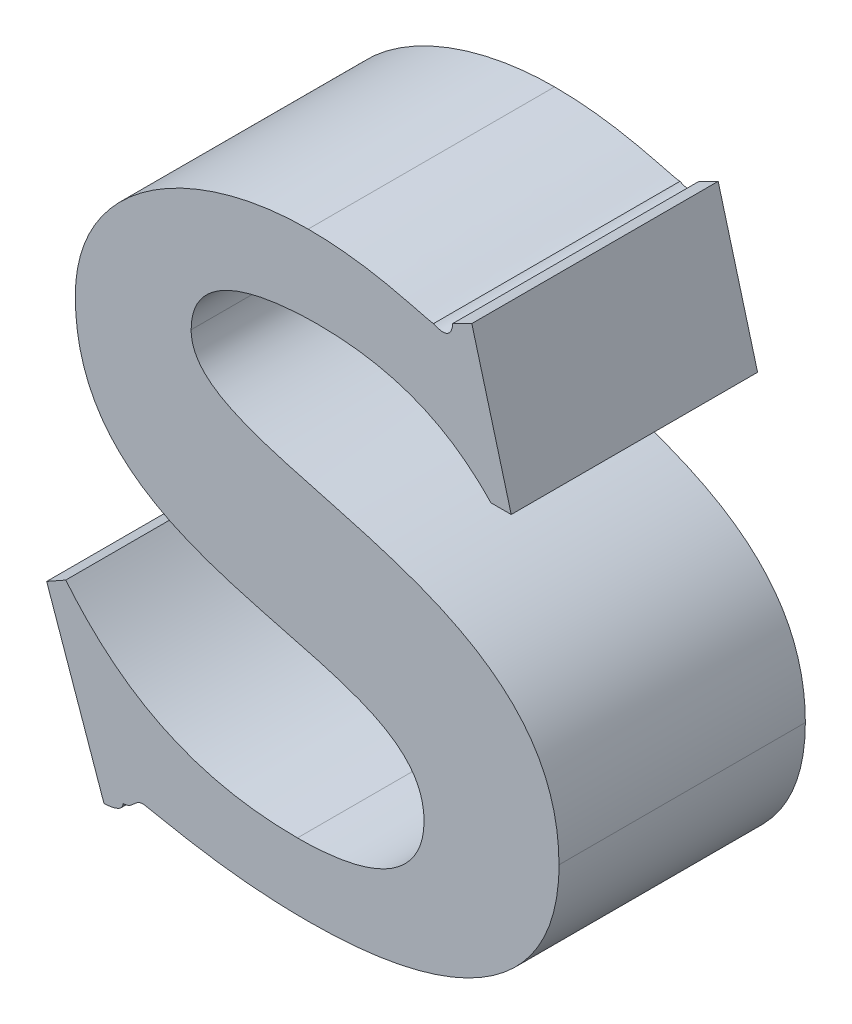
ISO-10303-21;
HEADER;
FILE_DESCRIPTION(('STEP AP214'),'2;1');
FILE_NAME('part.step','',(''),(''),'','','');
FILE_SCHEMA(('AUTOMOTIVE_DESIGN { 1 0 10303 214 1 1 1 1 }'));
ENDSEC;
DATA;
#1=APPLICATION_CONTEXT('core data for automotive mechanical design processes');
#2=APPLICATION_PROTOCOL_DEFINITION('international standard','automotive_design',2000,#1);
#3=PRODUCT_CONTEXT('',#1,'mechanical');
#4=PRODUCT('Part','Part','',(#3));
#5=PRODUCT_RELATED_PRODUCT_CATEGORY('part','',(#4));
#6=PRODUCT_DEFINITION_FORMATION('','',#4);
#7=PRODUCT_DEFINITION_CONTEXT('part definition',#1,'design');
#8=PRODUCT_DEFINITION('design','',#6,#7);
#9=PRODUCT_DEFINITION_SHAPE('','',#8);
#10=(LENGTH_UNIT() NAMED_UNIT(*) SI_UNIT(.MILLI.,.METRE.));
#11=(NAMED_UNIT(*) PLANE_ANGLE_UNIT() SI_UNIT($,.RADIAN.));
#12=(NAMED_UNIT(*) SI_UNIT($,.STERADIAN.) SOLID_ANGLE_UNIT());
#13=UNCERTAINTY_MEASURE_WITH_UNIT(LENGTH_MEASURE(1.E-05),#10,'distance_accuracy_value','');
#14=(GEOMETRIC_REPRESENTATION_CONTEXT(3) GLOBAL_UNCERTAINTY_ASSIGNED_CONTEXT((#13)) GLOBAL_UNIT_ASSIGNED_CONTEXT((#10,
#11,#12)) REPRESENTATION_CONTEXT('',''));
#15=CARTESIAN_POINT('',(0.,0.,0.));
#16=DIRECTION('',(0.,0.,1.));
#17=DIRECTION('',(1.,0.,0.));
#18=AXIS2_PLACEMENT_3D('',#15,#16,#17);
#19=CARTESIAN_POINT('',(2.6647318819596,-0.404903421996989,0.));
#20=CARTESIAN_POINT('',(2.6647318819596,-0.404903421996989,0.1));
#21=CARTESIAN_POINT('',(2.6177093414858,-0.40490342397876,0.));
#22=CARTESIAN_POINT('',(2.6177093414858,-0.40490342397876,0.1));
#23=CARTESIAN_POINT('',(2.590077700991,-0.385027744073725,0.));
#24=CARTESIAN_POINT('',(2.590077700991,-0.385027744073725,0.1));
#25=CARTESIAN_POINT('',(2.5706864443915,-0.361273812994394,0.));
#26=CARTESIAN_POINT('',(2.5706864443915,-0.361273812994394,0.1));
#27=B_SPLINE_SURFACE_WITH_KNOTS('',3,1,((#19,#20),(#21,#22),(#23,#24),(#25,#26)),.UNSPECIFIED.,
.F.,.F.,.F.,(4,4),(2,2),(-1.,0.),(0.,0.01),.UNSPECIFIED.);
#28=CARTESIAN_POINT('',(2.5706864443915,-0.361273812994394,0.));
#29=CARTESIAN_POINT('',(2.590077700991,-0.385027744073725,0.));
#30=CARTESIAN_POINT('',(2.6177093414858,-0.40490342397876,0.));
#31=CARTESIAN_POINT('',(2.6647318819596,-0.404903421996989,0.));
#32=B_SPLINE_CURVE_WITH_KNOTS('',3,(#28,#29,#30,#31),.UNSPECIFIED.,.F.,.F.,(4,4),(0.,1.),.UNSPECIFIED.);
#33=CARTESIAN_POINT('',(2.5706864443915,-0.361273812994394,0.));
#34=VERTEX_POINT('',#33);
#35=CARTESIAN_POINT('',(2.6647318819596,-0.404903421996989,0.));
#36=VERTEX_POINT('',#35);
#37=EDGE_CURVE('E11',#34,#36,#32,.T.);
#38=DIRECTION('',(0.,0.,1.));
#39=VECTOR('',#38,1.);
#40=CARTESIAN_POINT('',(2.5706864443915,-0.361273812994394,0.));
#41=LINE('',#40,#39);
#42=CARTESIAN_POINT('',(2.5706864443915,-0.361273812994394,0.1));
#43=VERTEX_POINT('',#42);
#44=EDGE_CURVE('E28',#34,#43,#41,.T.);
#45=CARTESIAN_POINT('',(2.6647318819596,-0.404903421996989,0.1));
#46=CARTESIAN_POINT('',(2.6177093414858,-0.40490342397876,0.1));
#47=CARTESIAN_POINT('',(2.590077700991,-0.385027744073725,0.1));
#48=CARTESIAN_POINT('',(2.5706864443915,-0.361273812994394,0.1));
#49=B_SPLINE_CURVE_WITH_KNOTS('',3,(#45,#46,#47,#48),.UNSPECIFIED.,.F.,.F.,(4,4),(-1.,0.),.UNSPECIFIED.);
#50=CARTESIAN_POINT('',(2.6647318819596,-0.404903421996989,0.1));
#51=VERTEX_POINT('',#50);
#52=EDGE_CURVE('E164',#51,#43,#49,.T.);
#53=DIRECTION('',(0.,0.,1.));
#54=VECTOR('',#53,1.);
#55=CARTESIAN_POINT('',(2.6647318819596,-0.404903421996989,0.));
#56=LINE('',#55,#54);
#57=EDGE_CURVE('E402',#36,#51,#56,.T.);
#58=ORIENTED_EDGE('',*,*,#37,.F.);
#59=ORIENTED_EDGE('',*,*,#44,.T.);
#60=ORIENTED_EDGE('',*,*,#52,.F.);
#61=ORIENTED_EDGE('',*,*,#57,.F.);
#62=EDGE_LOOP('',(#58,#59,#60,#61));
#63=FACE_BOUND('',#62,.T.);
#64=ADVANCED_FACE('F17',(#63),#27,.T.);
#65=CARTESIAN_POINT('',(2.7161187145981,-0.373393240904983,0.));
#66=CARTESIAN_POINT('',(2.7161187145981,-0.373393240904983,0.1));
#67=CARTESIAN_POINT('',(2.7161187148362,-0.388905851422519,0.));
#68=CARTESIAN_POINT('',(2.7161187148362,-0.388905851422519,0.1));
#69=CARTESIAN_POINT('',(2.7039997190464,-0.404903422582029,0.));
#70=CARTESIAN_POINT('',(2.7039997190464,-0.404903422582029,0.1));
#71=CARTESIAN_POINT('',(2.6647318819596,-0.404903421996989,0.));
#72=CARTESIAN_POINT('',(2.6647318819596,-0.404903421996989,0.1));
#73=B_SPLINE_SURFACE_WITH_KNOTS('',3,1,((#65,#66),(#67,#68),(#69,#70),(#71,#72)),.UNSPECIFIED.,
.F.,.F.,.F.,(4,4),(2,2),(-1.,0.),(0.,0.01),.UNSPECIFIED.);
#74=CARTESIAN_POINT('',(2.6647318819596,-0.404903421996989,0.));
#75=CARTESIAN_POINT('',(2.7039997190464,-0.404903422582029,0.));
#76=CARTESIAN_POINT('',(2.7161187148362,-0.388905851422519,0.));
#77=CARTESIAN_POINT('',(2.7161187145981,-0.373393240904983,0.));
#78=B_SPLINE_CURVE_WITH_KNOTS('',3,(#74,#75,#76,#77),.UNSPECIFIED.,.F.,.F.,(4,4),(0.,1.),.UNSPECIFIED.);
#79=CARTESIAN_POINT('',(2.7161187145981,-0.373393240904983,0.));
#80=VERTEX_POINT('',#79);
#81=EDGE_CURVE('E395',#36,#80,#78,.T.);
#82=CARTESIAN_POINT('',(2.7161187145981,-0.373393240904983,0.1));
#83=CARTESIAN_POINT('',(2.7161187148362,-0.388905851422519,0.1));
#84=CARTESIAN_POINT('',(2.7039997190464,-0.404903422582029,0.1));
#85=CARTESIAN_POINT('',(2.6647318819596,-0.404903421996989,0.1));
#86=B_SPLINE_CURVE_WITH_KNOTS('',3,(#82,#83,#84,#85),.UNSPECIFIED.,.F.,.F.,(4,4),(-1.,0.),.UNSPECIFIED.);
#87=CARTESIAN_POINT('',(2.7161187145981,-0.373393240904983,0.1));
#88=VERTEX_POINT('',#87);
#89=EDGE_CURVE('E391',#88,#51,#86,.T.);
#90=DIRECTION('',(0.,0.,1.));
#91=VECTOR('',#90,1.);
#92=CARTESIAN_POINT('',(2.7161187145981,-0.373393240904983,0.));
#93=LINE('',#92,#91);
#94=EDGE_CURVE('E385',#80,#88,#93,.T.);
#95=ORIENTED_EDGE('',*,*,#81,.F.);
#96=ORIENTED_EDGE('',*,*,#57,.T.);
#97=ORIENTED_EDGE('',*,*,#89,.F.);
#98=ORIENTED_EDGE('',*,*,#94,.F.);
#99=EDGE_LOOP('',(#95,#96,#97,#98));
#100=FACE_BOUND('',#99,.T.);
#101=ADVANCED_FACE('F472',(#100),#73,.T.);
#102=CARTESIAN_POINT('',(2.5745654165082,-0.259471656208063,0.));
#103=CARTESIAN_POINT('',(2.5745654165082,-0.259471656208063,0.1));
#104=CARTESIAN_POINT('',(2.5745654166313,-0.353517561290755,0.));
#105=CARTESIAN_POINT('',(2.5745654166313,-0.353517561290755,0.1));
#106=CARTESIAN_POINT('',(2.7161187149396,-0.318129093521967,0.));
#107=CARTESIAN_POINT('',(2.7161187149396,-0.318129093521967,0.1));
#108=CARTESIAN_POINT('',(2.7161187145981,-0.373393240904983,0.));
#109=CARTESIAN_POINT('',(2.7161187145981,-0.373393240904983,0.1));
#110=B_SPLINE_SURFACE_WITH_KNOTS('',3,1,((#102,#103),(#104,#105),(#106,#107),(#108,#109)),
.UNSPECIFIED.,.F.,.F.,.F.,(4,4),(2,2),(-1.,0.),(0.,0.01),.UNSPECIFIED.);
#111=CARTESIAN_POINT('',(2.7161187145981,-0.373393240904983,0.));
#112=CARTESIAN_POINT('',(2.7161187149396,-0.318129093521967,0.));
#113=CARTESIAN_POINT('',(2.5745654166313,-0.353517561290755,0.));
#114=CARTESIAN_POINT('',(2.5745654165082,-0.259471656208063,0.));
#115=B_SPLINE_CURVE_WITH_KNOTS('',3,(#111,#112,#113,#114),.UNSPECIFIED.,.F.,.F.,(4,4),(0.,1.),.UNSPECIFIED.);
#116=CARTESIAN_POINT('',(2.5745654165082,-0.259471656208063,0.));
#117=VERTEX_POINT('',#116);
#118=EDGE_CURVE('E378',#80,#117,#115,.T.);
#119=CARTESIAN_POINT('',(2.5745654165082,-0.259471656208063,0.1));
#120=CARTESIAN_POINT('',(2.5745654166313,-0.353517561290755,0.1));
#121=CARTESIAN_POINT('',(2.7161187149396,-0.318129093521967,0.1));
#122=CARTESIAN_POINT('',(2.7161187145981,-0.373393240904983,0.1));
#123=B_SPLINE_CURVE_WITH_KNOTS('',3,(#119,#120,#121,#122),.UNSPECIFIED.,.F.,.F.,(4,4),(-1.,0.),.UNSPECIFIED.);
#124=CARTESIAN_POINT('',(2.5745654165082,-0.259471656208063,0.1));
#125=VERTEX_POINT('',#124);
#126=EDGE_CURVE('E373',#125,#88,#123,.T.);
#127=DIRECTION('',(0.,0.,1.));
#128=VECTOR('',#127,1.);
#129=CARTESIAN_POINT('',(2.5745654165082,-0.259471656208063,0.));
#130=LINE('',#129,#128);
#131=EDGE_CURVE('E367',#117,#125,#130,.T.);
#132=ORIENTED_EDGE('',*,*,#118,.F.);
#133=ORIENTED_EDGE('',*,*,#94,.T.);
#134=ORIENTED_EDGE('',*,*,#126,.F.);
#135=ORIENTED_EDGE('',*,*,#131,.F.);
#136=EDGE_LOOP('',(#132,#133,#134,#135));
#137=FACE_BOUND('',#136,.T.);
#138=ADVANCED_FACE('F468',(#137),#110,.T.);
#139=CARTESIAN_POINT('',(2.6690958156656,-0.188694899074161,0.));
#140=CARTESIAN_POINT('',(2.6690958156656,-0.188694899074161,0.1));
#141=CARTESIAN_POINT('',(2.6215879566338,-0.188694900065156,0.));
#142=CARTESIAN_POINT('',(2.6215879566338,-0.188694900065156,0.1));
#143=CARTESIAN_POINT('',(2.574565417417,-0.216326792616405,0.));
#144=CARTESIAN_POINT('',(2.574565417417,-0.216326792616405,0.1));
#145=CARTESIAN_POINT('',(2.5745654165082,-0.259471656208063,0.));
#146=CARTESIAN_POINT('',(2.5745654165082,-0.259471656208063,0.1));
#147=B_SPLINE_SURFACE_WITH_KNOTS('',3,1,((#139,#140),(#141,#142),(#143,#144),(#145,#146)),
.UNSPECIFIED.,.F.,.F.,.F.,(4,4),(2,2),(-1.,0.),(0.,0.01),.UNSPECIFIED.);
#148=CARTESIAN_POINT('',(2.5745654165082,-0.259471656208063,0.));
#149=CARTESIAN_POINT('',(2.574565417417,-0.216326792616405,0.));
#150=CARTESIAN_POINT('',(2.6215879566338,-0.188694900065156,0.));
#151=CARTESIAN_POINT('',(2.6690958156656,-0.188694899074161,0.));
#152=B_SPLINE_CURVE_WITH_KNOTS('',3,(#148,#149,#150,#151),.UNSPECIFIED.,.F.,.F.,(4,4),(0.,1.),.UNSPECIFIED.);
#153=CARTESIAN_POINT('',(2.6690958156656,-0.188694899074161,0.));
#154=VERTEX_POINT('',#153);
#155=EDGE_CURVE('E360',#117,#154,#152,.T.);
#156=CARTESIAN_POINT('',(2.6690958156656,-0.188694899074161,0.1));
#157=CARTESIAN_POINT('',(2.6215879566338,-0.188694900065156,0.1));
#158=CARTESIAN_POINT('',(2.574565417417,-0.216326792616405,0.1));
#159=CARTESIAN_POINT('',(2.5745654165082,-0.259471656208063,0.1));
#160=B_SPLINE_CURVE_WITH_KNOTS('',3,(#156,#157,#158,#159),.UNSPECIFIED.,.F.,.F.,(4,4),(-1.,0.),.UNSPECIFIED.);
#161=CARTESIAN_POINT('',(2.6690958156656,-0.188694899074161,0.1));
#162=VERTEX_POINT('',#161);
#163=EDGE_CURVE('E355',#162,#125,#160,.T.);
#164=DIRECTION('',(0.,0.,1.));
#165=VECTOR('',#164,1.);
#166=CARTESIAN_POINT('',(2.6690958156656,-0.188694899074161,0.));
#167=LINE('',#166,#165);
#168=EDGE_CURVE('E349',#154,#162,#167,.T.);
#169=ORIENTED_EDGE('',*,*,#155,.F.);
#170=ORIENTED_EDGE('',*,*,#131,.T.);
#171=ORIENTED_EDGE('',*,*,#163,.F.);
#172=ORIENTED_EDGE('',*,*,#168,.F.);
#173=EDGE_LOOP('',(#169,#170,#171,#172));
#174=FACE_BOUND('',#173,.T.);
#175=ADVANCED_FACE('F464',(#174),#147,.T.);
#176=CARTESIAN_POINT('',(2.719995885223,-0.196451257994637,0.));
#177=CARTESIAN_POINT('',(2.719995885223,-0.196451257994637,0.1));
#178=CARTESIAN_POINT('',(2.7161187144344,-0.196451258985635,0.));
#179=CARTESIAN_POINT('',(2.7161187144344,-0.196451258985635,0.1));
#180=CARTESIAN_POINT('',(2.6962421351109,-0.188694899646348,0.));
#181=CARTESIAN_POINT('',(2.6962421351109,-0.188694899646348,0.1));
#182=CARTESIAN_POINT('',(2.6690958156656,-0.188694899074161,0.));
#183=CARTESIAN_POINT('',(2.6690958156656,-0.188694899074161,0.1));
#184=B_SPLINE_SURFACE_WITH_KNOTS('',3,1,((#176,#177),(#178,#179),(#180,#181),(#182,#183)),
.UNSPECIFIED.,.F.,.F.,.F.,(4,4),(2,2),(-1.,0.),(0.,0.01),.UNSPECIFIED.);
#185=CARTESIAN_POINT('',(2.6690958156656,-0.188694899074161,0.));
#186=CARTESIAN_POINT('',(2.6962421351109,-0.188694899646348,0.));
#187=CARTESIAN_POINT('',(2.7161187144344,-0.196451258985635,0.));
#188=CARTESIAN_POINT('',(2.719995885223,-0.196451257994637,0.));
#189=B_SPLINE_CURVE_WITH_KNOTS('',3,(#185,#186,#187,#188),.UNSPECIFIED.,.F.,.F.,(4,4),(0.,1.),.UNSPECIFIED.);
#190=CARTESIAN_POINT('',(2.719995885223,-0.196451257994637,0.));
#191=VERTEX_POINT('',#190);
#192=EDGE_CURVE('E342',#154,#191,#189,.T.);
#193=CARTESIAN_POINT('',(2.719995885223,-0.196451257994637,0.1));
#194=CARTESIAN_POINT('',(2.7161187144344,-0.196451258985635,0.1));
#195=CARTESIAN_POINT('',(2.6962421351109,-0.188694899646348,0.1));
#196=CARTESIAN_POINT('',(2.6690958156656,-0.188694899074161,0.1));
#197=B_SPLINE_CURVE_WITH_KNOTS('',3,(#193,#194,#195,#196),.UNSPECIFIED.,.F.,.F.,(4,4),(-1.,0.),.UNSPECIFIED.);
#198=CARTESIAN_POINT('',(2.719995885223,-0.196451257994637,0.1));
#199=VERTEX_POINT('',#198);
#200=EDGE_CURVE('E337',#199,#162,#197,.T.);
#201=DIRECTION('',(0.,0.,1.));
#202=VECTOR('',#201,1.);
#203=CARTESIAN_POINT('',(2.719995885223,-0.196451257994637,0.));
#204=LINE('',#203,#202);
#205=EDGE_CURVE('E331',#191,#199,#204,.T.);
#206=ORIENTED_EDGE('',*,*,#192,.F.);
#207=ORIENTED_EDGE('',*,*,#168,.T.);
#208=ORIENTED_EDGE('',*,*,#200,.F.);
#209=ORIENTED_EDGE('',*,*,#205,.F.);
#210=EDGE_LOOP('',(#206,#207,#208,#209));
#211=FACE_BOUND('',#210,.T.);
#212=ADVANCED_FACE('F460',(#211),#184,.T.);
#213=CARTESIAN_POINT('',(2.7277523882628,-0.19257300647474,0.));
#214=CARTESIAN_POINT('',(2.7277523882628,-0.19257300647474,0.1));
#215=CARTESIAN_POINT('',(2.7277523882626,-0.192630756474797,0.));
#216=CARTESIAN_POINT('',(2.7277523882626,-0.192630756474797,0.1));
#217=CARTESIAN_POINT('',(2.7277523882626,-0.200329401424981,0.));
#218=CARTESIAN_POINT('',(2.7277523882626,-0.200329401424981,0.1));
#219=CARTESIAN_POINT('',(2.719995885223,-0.196451257994637,0.));
#220=CARTESIAN_POINT('',(2.719995885223,-0.196451257994637,0.1));
#221=B_SPLINE_SURFACE_WITH_KNOTS('',3,1,((#213,#214),(#215,#216),(#217,#218),(#219,#220)),
.UNSPECIFIED.,.F.,.F.,.F.,(4,4),(2,2),(-1.,0.),(0.,0.01),.UNSPECIFIED.);
#222=CARTESIAN_POINT('',(2.719995885223,-0.196451257994637,0.));
#223=CARTESIAN_POINT('',(2.7277523882626,-0.200329401424981,0.));
#224=CARTESIAN_POINT('',(2.7277523882626,-0.192630756474797,0.));
#225=CARTESIAN_POINT('',(2.7277523882628,-0.19257300647474,0.));
#226=B_SPLINE_CURVE_WITH_KNOTS('',3,(#222,#223,#224,#225),.UNSPECIFIED.,.F.,.F.,(4,4),(0.,1.),.UNSPECIFIED.);
#227=CARTESIAN_POINT('',(2.7277523882628,-0.19257300647474,0.));
#228=VERTEX_POINT('',#227);
#229=EDGE_CURVE('E324',#191,#228,#226,.T.);
#230=CARTESIAN_POINT('',(2.7277523882628,-0.19257300647474,0.1));
#231=CARTESIAN_POINT('',(2.7277523882626,-0.192630756474797,0.1));
#232=CARTESIAN_POINT('',(2.7277523882626,-0.200329401424981,0.1));
#233=CARTESIAN_POINT('',(2.719995885223,-0.196451257994637,0.1));
#234=B_SPLINE_CURVE_WITH_KNOTS('',3,(#230,#231,#232,#233),.UNSPECIFIED.,.F.,.F.,(4,4),(-1.,0.),.UNSPECIFIED.);
#235=CARTESIAN_POINT('',(2.7277523882628,-0.19257300647474,0.1));
#236=VERTEX_POINT('',#235);
#237=EDGE_CURVE('E319',#236,#199,#234,.T.);
#238=DIRECTION('',(0.,0.,1.));
#239=VECTOR('',#238,1.);
#240=CARTESIAN_POINT('',(2.7277523882628,-0.19257300647474,0.));
#241=LINE('',#240,#239);
#242=EDGE_CURVE('E316',#228,#236,#241,.T.);
#243=ORIENTED_EDGE('',*,*,#229,.F.);
#244=ORIENTED_EDGE('',*,*,#205,.T.);
#245=ORIENTED_EDGE('',*,*,#237,.F.);
#246=ORIENTED_EDGE('',*,*,#242,.F.);
#247=EDGE_LOOP('',(#243,#244,#245,#246));
#248=FACE_BOUND('',#247,.T.);
#249=ADVANCED_FACE('F456',(#248),#221,.T.);
#250=CARTESIAN_POINT('',(2.7355099721977,-0.188694899074161,0.));
#251=DIRECTION('',(-0.447150449279358,0.894458761324002,0.));
#252=DIRECTION('',(-0.894458761324002,-0.447150449279358,0.));
#253=AXIS2_PLACEMENT_3D('',#250,#251,#252);
#254=PLANE('',#253);
#255=DIRECTION('',(0.894458761324002,0.447150449279358,0.));
#256=VECTOR('',#255,1.);
#257=CARTESIAN_POINT('',(2.7277523882628,-0.19257300647474,0.));
#258=LINE('',#257,#256);
#259=CARTESIAN_POINT('',(2.7355099721977,-0.188694899074161,0.));
#260=VERTEX_POINT('',#259);
#261=EDGE_CURVE('E314',#228,#260,#258,.T.);
#262=ORIENTED_EDGE('',*,*,#261,.F.);
#263=ORIENTED_EDGE('',*,*,#242,.T.);
#264=DIRECTION('',(-0.894458761324002,-0.447150449279358,0.));
#265=VECTOR('',#264,1.);
#266=CARTESIAN_POINT('',(2.7277523882628,-0.19257300647474,0.1));
#267=LINE('',#266,#265);
#268=CARTESIAN_POINT('',(2.7355099721977,-0.188694899074161,0.1));
#269=VERTEX_POINT('',#268);
#270=EDGE_CURVE('E311',#269,#236,#267,.T.);
#271=ORIENTED_EDGE('',*,*,#270,.F.);
#272=DIRECTION('',(0.,0.,1.));
#273=VECTOR('',#272,1.);
#274=CARTESIAN_POINT('',(2.7355099721977,-0.188694899074161,0.));
#275=LINE('',#274,#273);
#276=EDGE_CURVE('E308',#260,#269,#275,.T.);
#277=ORIENTED_EDGE('',*,*,#276,.F.);
#278=EDGE_LOOP('',(#262,#263,#271,#277));
#279=FACE_BOUND('',#278,.T.);
#280=ADVANCED_FACE('F452',(#279),#254,.T.);
#281=CARTESIAN_POINT('',(2.7515061383747,-0.247837117827599,0.));
#282=DIRECTION('',(0.965314937156608,0.261088245814197,0.));
#283=DIRECTION('',(-0.261088245814197,0.965314937156608,0.));
#284=AXIS2_PLACEMENT_3D('',#281,#282,#283);
#285=PLANE('',#284);
#286=DIRECTION('',(0.261088245814197,-0.965314937156608,0.));
#287=VECTOR('',#286,1.);
#288=CARTESIAN_POINT('',(2.7355099721977,-0.188694899074161,0.));
#289=LINE('',#288,#287);
#290=CARTESIAN_POINT('',(2.7515061383747,-0.247837117827599,0.));
#291=VERTEX_POINT('',#290);
#292=EDGE_CURVE('E306',#260,#291,#289,.T.);
#293=ORIENTED_EDGE('',*,*,#292,.F.);
#294=ORIENTED_EDGE('',*,*,#276,.T.);
#295=DIRECTION('',(-0.261088245814197,0.965314937156608,0.));
#296=VECTOR('',#295,1.);
#297=CARTESIAN_POINT('',(2.7355099721977,-0.188694899074161,0.1));
#298=LINE('',#297,#296);
#299=CARTESIAN_POINT('',(2.7515061383747,-0.247837117827599,0.1));
#300=VERTEX_POINT('',#299);
#301=EDGE_CURVE('E303',#300,#269,#298,.T.);
#302=ORIENTED_EDGE('',*,*,#301,.F.);
#303=DIRECTION('',(0.,0.,1.));
#304=VECTOR('',#303,1.);
#305=CARTESIAN_POINT('',(2.7515061383747,-0.247837117827599,0.));
#306=LINE('',#305,#304);
#307=EDGE_CURVE('E300',#291,#300,#306,.T.);
#308=ORIENTED_EDGE('',*,*,#307,.F.);
#309=EDGE_LOOP('',(#293,#294,#302,#308));
#310=FACE_BOUND('',#309,.T.);
#311=ADVANCED_FACE('F448',(#310),#285,.T.);
#312=CARTESIAN_POINT('',(2.7432661149391,-0.247837117827599,0.));
#313=DIRECTION('',(0.,-1.,0.));
#314=DIRECTION('',(1.,0.,0.));
#315=AXIS2_PLACEMENT_3D('',#312,#313,#314);
#316=PLANE('',#315);
#317=DIRECTION('',(-1.,0.,0.));
#318=VECTOR('',#317,1.);
#319=CARTESIAN_POINT('',(2.7515061383747,-0.247837117827599,0.));
#320=LINE('',#319,#318);
#321=CARTESIAN_POINT('',(2.7432661149391,-0.247837117827599,0.));
#322=VERTEX_POINT('',#321);
#323=EDGE_CURVE('E298',#291,#322,#320,.T.);
#324=ORIENTED_EDGE('',*,*,#323,.F.);
#325=ORIENTED_EDGE('',*,*,#307,.T.);
#326=DIRECTION('',(1.,0.,0.));
#327=VECTOR('',#326,1.);
#328=CARTESIAN_POINT('',(2.7515061383747,-0.247837117827599,0.1));
#329=LINE('',#328,#327);
#330=CARTESIAN_POINT('',(2.7432661149391,-0.247837117827599,0.1));
#331=VERTEX_POINT('',#330);
#332=EDGE_CURVE('E295',#331,#300,#329,.T.);
#333=ORIENTED_EDGE('',*,*,#332,.F.);
#334=DIRECTION('',(0.,0.,1.));
#335=VECTOR('',#334,1.);
#336=CARTESIAN_POINT('',(2.7432661149391,-0.247837117827599,0.));
#337=LINE('',#336,#335);
#338=EDGE_CURVE('E289',#322,#331,#337,.T.);
#339=ORIENTED_EDGE('',*,*,#338,.F.);
#340=EDGE_LOOP('',(#324,#325,#333,#339));
#341=FACE_BOUND('',#340,.T.);
#342=ADVANCED_FACE('F444',(#341),#316,.T.);
#343=CARTESIAN_POINT('',(2.6729733465882,-0.220205080166189,0.));
#344=CARTESIAN_POINT('',(2.6729733465882,-0.220205080166189,0.1));
#345=CARTESIAN_POINT('',(2.712239742893,-0.220205079703751,0.));
#346=CARTESIAN_POINT('',(2.712239742893,-0.220205079703751,0.1));
#347=CARTESIAN_POINT('',(2.7316310002617,-0.235717833863522,0.));
#348=CARTESIAN_POINT('',(2.7316310002617,-0.235717833863522,0.1));
#349=CARTESIAN_POINT('',(2.7432661149391,-0.247837117827599,0.));
#350=CARTESIAN_POINT('',(2.7432661149391,-0.247837117827599,0.1));
#351=B_SPLINE_SURFACE_WITH_KNOTS('',3,1,((#343,#344),(#345,#346),(#347,#348),(#349,#350)),
.UNSPECIFIED.,.F.,.F.,.F.,(4,4),(2,2),(-1.,0.),(0.,0.01),.UNSPECIFIED.);
#352=CARTESIAN_POINT('',(2.7432661149391,-0.247837117827599,0.));
#353=CARTESIAN_POINT('',(2.7316310002617,-0.235717833863522,0.));
#354=CARTESIAN_POINT('',(2.712239742893,-0.220205079703751,0.));
#355=CARTESIAN_POINT('',(2.6729733465882,-0.220205080166189,0.));
#356=B_SPLINE_CURVE_WITH_KNOTS('',3,(#352,#353,#354,#355),.UNSPECIFIED.,.F.,.F.,(4,4),(0.,1.),.UNSPECIFIED.);
#357=CARTESIAN_POINT('',(2.6729733465882,-0.220205080166189,0.));
#358=VERTEX_POINT('',#357);
#359=EDGE_CURVE('E282',#322,#358,#356,.T.);
#360=CARTESIAN_POINT('',(2.6729733465882,-0.220205080166189,0.1));
#361=CARTESIAN_POINT('',(2.712239742893,-0.220205079703751,0.1));
#362=CARTESIAN_POINT('',(2.7316310002617,-0.235717833863522,0.1));
#363=CARTESIAN_POINT('',(2.7432661149391,-0.247837117827599,0.1));
#364=B_SPLINE_CURVE_WITH_KNOTS('',3,(#360,#361,#362,#363),.UNSPECIFIED.,.F.,.F.,(4,4),(-1.,0.),.UNSPECIFIED.);
#365=CARTESIAN_POINT('',(2.6729733465882,-0.220205080166189,0.1));
#366=VERTEX_POINT('',#365);
#367=EDGE_CURVE('E277',#366,#331,#364,.T.);
#368=DIRECTION('',(0.,0.,1.));
#369=VECTOR('',#368,1.);
#370=CARTESIAN_POINT('',(2.6729733465882,-0.220205080166189,0.));
#371=LINE('',#370,#369);
#372=EDGE_CURVE('E271',#358,#366,#371,.T.);
#373=ORIENTED_EDGE('',*,*,#359,.F.);
#374=ORIENTED_EDGE('',*,*,#338,.T.);
#375=ORIENTED_EDGE('',*,*,#367,.F.);
#376=ORIENTED_EDGE('',*,*,#372,.F.);
#377=EDGE_LOOP('',(#373,#374,#375,#376));
#378=FACE_BOUND('',#377,.T.);
#379=ADVANCED_FACE('F440',(#378),#351,.T.);
#380=CARTESIAN_POINT('',(2.6215879551428,-0.247837117827599,0.));
#381=CARTESIAN_POINT('',(2.6215879551428,-0.247837117827599,0.1));
#382=CARTESIAN_POINT('',(2.6215879547706,-0.245185414666545,0.));
#383=CARTESIAN_POINT('',(2.6215879547706,-0.245185414666545,0.1));
#384=CARTESIAN_POINT('',(2.6219806273209,-0.242579332437002,0.));
#385=CARTESIAN_POINT('',(2.6219806273209,-0.242579332437002,0.1));
#386=CARTESIAN_POINT('',(2.6237112146975,-0.237812146489558,0.));
#387=CARTESIAN_POINT('',(2.6237112146975,-0.237812146489558,0.1));
#388=CARTESIAN_POINT('',(2.6249194012147,-0.235753899417539,0.));
#389=CARTESIAN_POINT('',(2.6249194012147,-0.235753899417539,0.1));
#390=CARTESIAN_POINT('',(2.6287453627049,-0.231198421562123,0.));
#391=CARTESIAN_POINT('',(2.6287453627049,-0.231198421562123,0.1));
#392=CARTESIAN_POINT('',(2.6316296571141,-0.229082262739428,0.));
#393=CARTESIAN_POINT('',(2.6316296571141,-0.229082262739428,0.1));
#394=CARTESIAN_POINT('',(2.6391651918368,-0.22503901398281,0.));
#395=CARTESIAN_POINT('',(2.6391651918368,-0.22503901398281,0.1));
#396=CARTESIAN_POINT('',(2.6442332446792,-0.223472537570603,0.));
#397=CARTESIAN_POINT('',(2.6442332446792,-0.223472537570603,0.1));
#398=CARTESIAN_POINT('',(2.6567919171044,-0.220801149663606,0.));
#399=CARTESIAN_POINT('',(2.6567919171044,-0.220801149663606,0.1));
#400=CARTESIAN_POINT('',(2.6651813495268,-0.220205080050052,0.));
#401=CARTESIAN_POINT('',(2.6651813495268,-0.220205080050052,0.1));
#402=CARTESIAN_POINT('',(2.6729733465882,-0.220205080166189,0.));
#403=CARTESIAN_POINT('',(2.6729733465882,-0.220205080166189,0.1));
#404=B_SPLINE_SURFACE_WITH_KNOTS('',3,1,((#380,#381),(#382,#383),(#384,#385),(#386,#387),(#388,
#389),(#390,#391),(#392,#393),(#394,#395),(#396,#397),(#398,#399),(#400,#401),(#402,#403)),
.UNSPECIFIED.,.F.,.F.,.F.,(4,2,2,2,2,4),(2,2),(-0.0055492908626531,-0.0048632059133022,
-0.0042370343281689,-0.0033238969235524,-0.002023895340651,0.),(0.,0.01),.UNSPECIFIED.);
#405=CARTESIAN_POINT('',(2.6729733465882,-0.220205080166189,0.));
#406=CARTESIAN_POINT('',(2.6651813495268,-0.220205080050052,0.));
#407=CARTESIAN_POINT('',(2.6567919171044,-0.220801149663606,0.));
#408=CARTESIAN_POINT('',(2.6442332446792,-0.223472537570603,0.));
#409=CARTESIAN_POINT('',(2.6391651918368,-0.22503901398281,0.));
#410=CARTESIAN_POINT('',(2.6316296571141,-0.229082262739428,0.));
#411=CARTESIAN_POINT('',(2.6287453627049,-0.231198421562123,0.));
#412=CARTESIAN_POINT('',(2.6249194012147,-0.235753899417539,0.));
#413=CARTESIAN_POINT('',(2.6237112146975,-0.237812146489558,0.));
#414=CARTESIAN_POINT('',(2.6219806273209,-0.242579332437002,0.));
#415=CARTESIAN_POINT('',(2.6215879547706,-0.245185414666545,0.));
#416=CARTESIAN_POINT('',(2.6215879551428,-0.247837117827599,0.));
#417=B_SPLINE_CURVE_WITH_KNOTS('',3,(#405,#406,#407,#408,#409,#410,#411,#412,#413,#414,#415,
#416),.UNSPECIFIED.,.F.,.F.,(4,2,2,2,2,4),(0.,0.002023895340651,0.0033238969235524,
0.0042370343281689,0.0048632059133022,0.0055492908626531),.UNSPECIFIED.);
#418=CARTESIAN_POINT('',(2.6215879551428,-0.247837117827599,0.));
#419=VERTEX_POINT('',#418);
#420=EDGE_CURVE('E264',#358,#419,#417,.T.);
#421=CARTESIAN_POINT('',(2.6215879551428,-0.247837117827599,0.1));
#422=CARTESIAN_POINT('',(2.6215879547706,-0.245185414666545,0.1));
#423=CARTESIAN_POINT('',(2.6219806273209,-0.242579332437002,0.1));
#424=CARTESIAN_POINT('',(2.6237112146975,-0.237812146489558,0.1));
#425=CARTESIAN_POINT('',(2.6249194012147,-0.235753899417539,0.1));
#426=CARTESIAN_POINT('',(2.6287453627049,-0.231198421562123,0.1));
#427=CARTESIAN_POINT('',(2.6316296571141,-0.229082262739428,0.1));
#428=CARTESIAN_POINT('',(2.6391651918368,-0.22503901398281,0.1));
#429=CARTESIAN_POINT('',(2.6442332446792,-0.223472537570603,0.1));
#430=CARTESIAN_POINT('',(2.6567919171044,-0.220801149663606,0.1));
#431=CARTESIAN_POINT('',(2.6651813495268,-0.220205080050052,0.1));
#432=CARTESIAN_POINT('',(2.6729733465882,-0.220205080166189,0.1));
#433=B_SPLINE_CURVE_WITH_KNOTS('',3,(#421,#422,#423,#424,#425,#426,#427,#428,#429,#430,#431,
#432),.UNSPECIFIED.,.F.,.F.,(4,2,2,2,2,4),(-0.0055492908626531,-0.0048632059133022,
-0.0042370343281689,-0.0033238969235524,-0.002023895340651,0.),.UNSPECIFIED.);
#434=CARTESIAN_POINT('',(2.6215879551428,-0.247837117827599,0.1));
#435=VERTEX_POINT('',#434);
#436=EDGE_CURVE('E259',#435,#366,#433,.T.);
#437=DIRECTION('',(0.,0.,1.));
#438=VECTOR('',#437,1.);
#439=CARTESIAN_POINT('',(2.6215879551428,-0.247837117827599,0.));
#440=LINE('',#439,#438);
#441=EDGE_CURVE('E253',#419,#435,#440,.T.);
#442=ORIENTED_EDGE('',*,*,#420,.F.);
#443=ORIENTED_EDGE('',*,*,#372,.T.);
#444=ORIENTED_EDGE('',*,*,#436,.F.);
#445=ORIENTED_EDGE('',*,*,#441,.F.);
#446=EDGE_LOOP('',(#442,#443,#444,#445));
#447=FACE_BOUND('',#446,.T.);
#448=ADVANCED_FACE('F436',(#447),#404,.T.);
#449=CARTESIAN_POINT('',(2.7708973959742,-0.361273812994394,0.));
#450=CARTESIAN_POINT('',(2.7708973959742,-0.361273812994394,0.1));
#451=CARTESIAN_POINT('',(2.770897396263,-0.267228012903883,0.));
#452=CARTESIAN_POINT('',(2.770897396263,-0.267228012903883,0.1));
#453=CARTESIAN_POINT('',(2.621587955786,-0.290981837300016,0.));
#454=CARTESIAN_POINT('',(2.621587955786,-0.290981837300016,0.1));
#455=CARTESIAN_POINT('',(2.6215879551428,-0.247837117827599,0.));
#456=CARTESIAN_POINT('',(2.6215879551428,-0.247837117827599,0.1));
#457=B_SPLINE_SURFACE_WITH_KNOTS('',3,1,((#449,#450),(#451,#452),(#453,#454),(#455,#456)),
.UNSPECIFIED.,.F.,.F.,.F.,(4,4),(2,2),(-1.,0.),(0.,0.01),.UNSPECIFIED.);
#458=CARTESIAN_POINT('',(2.6215879551428,-0.247837117827599,0.));
#459=CARTESIAN_POINT('',(2.621587955786,-0.290981837300016,0.));
#460=CARTESIAN_POINT('',(2.770897396263,-0.267228012903883,0.));
#461=CARTESIAN_POINT('',(2.7708973959742,-0.361273812994394,0.));
#462=B_SPLINE_CURVE_WITH_KNOTS('',3,(#458,#459,#460,#461),.UNSPECIFIED.,.F.,.F.,(4,4),(0.,1.),.UNSPECIFIED.);
#463=CARTESIAN_POINT('',(2.7708973959742,-0.361273812994394,0.));
#464=VERTEX_POINT('',#463);
#465=EDGE_CURVE('E246',#419,#464,#462,.T.);
#466=CARTESIAN_POINT('',(2.7708973959742,-0.361273812994394,0.1));
#467=CARTESIAN_POINT('',(2.770897396263,-0.267228012903883,0.1));
#468=CARTESIAN_POINT('',(2.621587955786,-0.290981837300016,0.1));
#469=CARTESIAN_POINT('',(2.6215879551428,-0.247837117827599,0.1));
#470=B_SPLINE_CURVE_WITH_KNOTS('',3,(#466,#467,#468,#469),.UNSPECIFIED.,.F.,.F.,(4,4),(-1.,0.),.UNSPECIFIED.);
#471=CARTESIAN_POINT('',(2.7708973959742,-0.361273812994394,0.1));
#472=VERTEX_POINT('',#471);
#473=EDGE_CURVE('E241',#472,#435,#470,.T.);
#474=DIRECTION('',(0.,0.,1.));
#475=VECTOR('',#474,1.);
#476=CARTESIAN_POINT('',(2.7708973959742,-0.361273812994394,0.));
#477=LINE('',#476,#475);
#478=EDGE_CURVE('E235',#464,#472,#477,.T.);
#479=ORIENTED_EDGE('',*,*,#465,.F.);
#480=ORIENTED_EDGE('',*,*,#441,.T.);
#481=ORIENTED_EDGE('',*,*,#473,.F.);
#482=ORIENTED_EDGE('',*,*,#478,.F.);
#483=EDGE_LOOP('',(#479,#480,#481,#482));
#484=FACE_BOUND('',#483,.T.);
#485=ADVANCED_FACE('F432',(#484),#457,.T.);
#486=CARTESIAN_POINT('',(2.6690958156656,-0.432050714249068,0.));
#487=CARTESIAN_POINT('',(2.6690958156656,-0.432050714249068,0.1));
#488=CARTESIAN_POINT('',(2.6847106180208,-0.432050715533267,0.));
#489=CARTESIAN_POINT('',(2.6847106180208,-0.432050715533267,0.1));
#490=CARTESIAN_POINT('',(2.700976438794,-0.430550069757881,0.));
#491=CARTESIAN_POINT('',(2.700976438794,-0.430550069757881,0.1));
#492=CARTESIAN_POINT('',(2.7259487911134,-0.423533957044502,0.));
#493=CARTESIAN_POINT('',(2.7259487911134,-0.423533957044502,0.1));
#494=CARTESIAN_POINT('',(2.7356899384477,-0.419437393304848,0.));
#495=CARTESIAN_POINT('',(2.7356899384477,-0.419437393304848,0.1));
#496=CARTESIAN_POINT('',(2.7510257986601,-0.408770350832469,0.));
#497=CARTESIAN_POINT('',(2.7510257986601,-0.408770350832469,0.1));
#498=CARTESIAN_POINT('',(2.7568943067349,-0.402944962494509,0.));
#499=CARTESIAN_POINT('',(2.7568943067349,-0.402944962494509,0.1));
#500=CARTESIAN_POINT('',(2.7645736318625,-0.390933216273536,0.));
#501=CARTESIAN_POINT('',(2.7645736318625,-0.390933216273536,0.1));
#502=CARTESIAN_POINT('',(2.7669328845028,-0.385545106289692,0.));
#503=CARTESIAN_POINT('',(2.7669328845028,-0.385545106289692,0.1));
#504=CARTESIAN_POINT('',(2.7701657753786,-0.373784201513488,0.));
#505=CARTESIAN_POINT('',(2.7701657753786,-0.373784201513488,0.1));
#506=CARTESIAN_POINT('',(2.7708973960673,-0.367547167990887,0.));
#507=CARTESIAN_POINT('',(2.7708973960673,-0.367547167990887,0.1));
#508=CARTESIAN_POINT('',(2.7708973959742,-0.361273812994394,0.));
#509=CARTESIAN_POINT('',(2.7708973959742,-0.361273812994394,0.1));
#510=B_SPLINE_SURFACE_WITH_KNOTS('',3,1,((#486,#487),(#488,#489),(#490,#491),(#492,#493),(#494,
#495),(#496,#497),(#498,#499),(#500,#501),(#502,#503),(#504,#505),(#506,#507),(#508,#509)),
.UNSPECIFIED.,.F.,.F.,.F.,(4,2,2,2,2,4),(2,2),(-0.0120611639581681,-0.0080203918455306,
-0.0053343351266161,-0.0031692791714983,-0.0016294428562032,0.),(0.,0.01),.UNSPECIFIED.);
#511=CARTESIAN_POINT('',(2.7708973959742,-0.361273812994394,0.));
#512=CARTESIAN_POINT('',(2.7708973960673,-0.367547167990887,0.));
#513=CARTESIAN_POINT('',(2.7701657753786,-0.373784201513488,0.));
#514=CARTESIAN_POINT('',(2.7669328845028,-0.385545106289692,0.));
#515=CARTESIAN_POINT('',(2.7645736318625,-0.390933216273536,0.));
#516=CARTESIAN_POINT('',(2.7568943067349,-0.402944962494509,0.));
#517=CARTESIAN_POINT('',(2.7510257986601,-0.408770350832469,0.));
#518=CARTESIAN_POINT('',(2.7356899384477,-0.419437393304848,0.));
#519=CARTESIAN_POINT('',(2.7259487911134,-0.423533957044502,0.));
#520=CARTESIAN_POINT('',(2.700976438794,-0.430550069757881,0.));
#521=CARTESIAN_POINT('',(2.6847106180208,-0.432050715533267,0.));
#522=CARTESIAN_POINT('',(2.6690958156656,-0.432050714249068,0.));
#523=B_SPLINE_CURVE_WITH_KNOTS('',3,(#511,#512,#513,#514,#515,#516,#517,#518,#519,#520,#521,
#522),.UNSPECIFIED.,.F.,.F.,(4,2,2,2,2,4),(0.,0.0016294428562032,0.0031692791714983,
0.0053343351266161,0.0080203918455306,0.0120611639581681),.UNSPECIFIED.);
#524=CARTESIAN_POINT('',(2.6690958156656,-0.432050714249068,0.));
#525=VERTEX_POINT('',#524);
#526=EDGE_CURVE('E228',#464,#525,#523,.T.);
#527=CARTESIAN_POINT('',(2.6690958156656,-0.432050714249068,0.1));
#528=CARTESIAN_POINT('',(2.6847106180208,-0.432050715533267,0.1));
#529=CARTESIAN_POINT('',(2.700976438794,-0.430550069757881,0.1));
#530=CARTESIAN_POINT('',(2.7259487911134,-0.423533957044502,0.1));
#531=CARTESIAN_POINT('',(2.7356899384477,-0.419437393304848,0.1));
#532=CARTESIAN_POINT('',(2.7510257986601,-0.408770350832469,0.1));
#533=CARTESIAN_POINT('',(2.7568943067349,-0.402944962494509,0.1));
#534=CARTESIAN_POINT('',(2.7645736318625,-0.390933216273536,0.1));
#535=CARTESIAN_POINT('',(2.7669328845028,-0.385545106289692,0.1));
#536=CARTESIAN_POINT('',(2.7701657753786,-0.373784201513488,0.1));
#537=CARTESIAN_POINT('',(2.7708973960673,-0.367547167990887,0.1));
#538=CARTESIAN_POINT('',(2.7708973959742,-0.361273812994394,0.1));
#539=B_SPLINE_CURVE_WITH_KNOTS('',3,(#527,#528,#529,#530,#531,#532,#533,#534,#535,#536,#537,
#538),.UNSPECIFIED.,.F.,.F.,(4,2,2,2,2,4),(-0.0120611639581681,-0.0080203918455306,
-0.0053343351266161,-0.0031692791714983,-0.0016294428562032,0.),.UNSPECIFIED.);
#540=CARTESIAN_POINT('',(2.6690958156656,-0.432050714249068,0.1));
#541=VERTEX_POINT('',#540);
#542=EDGE_CURVE('E223',#541,#472,#539,.T.);
#543=DIRECTION('',(0.,0.,1.));
#544=VECTOR('',#543,1.);
#545=CARTESIAN_POINT('',(2.6690958156656,-0.432050714249068,0.));
#546=LINE('',#545,#544);
#547=EDGE_CURVE('E217',#525,#541,#546,.T.);
#548=ORIENTED_EDGE('',*,*,#526,.F.);
#549=ORIENTED_EDGE('',*,*,#478,.T.);
#550=ORIENTED_EDGE('',*,*,#542,.F.);
#551=ORIENTED_EDGE('',*,*,#547,.F.);
#552=EDGE_LOOP('',(#548,#549,#550,#551));
#553=FACE_BOUND('',#552,.T.);
#554=ADVANCED_FACE('F428',(#553),#510,.T.);
#555=CARTESIAN_POINT('',(2.602196697544,-0.424294319298148,0.));
#556=CARTESIAN_POINT('',(2.602196697544,-0.424294319298148,0.1));
#557=CARTESIAN_POINT('',(2.6215879552582,-0.42817242528269,0.));
#558=CARTESIAN_POINT('',(2.6215879552582,-0.42817242528269,0.1));
#559=CARTESIAN_POINT('',(2.6414630934368,-0.4320507134255,0.));
#560=CARTESIAN_POINT('',(2.6414630934368,-0.4320507134255,0.1));
#561=CARTESIAN_POINT('',(2.6690958156656,-0.432050714249068,0.));
#562=CARTESIAN_POINT('',(2.6690958156656,-0.432050714249068,0.1));
#563=B_SPLINE_SURFACE_WITH_KNOTS('',3,1,((#555,#556),(#557,#558),(#559,#560),(#561,#562)),
.UNSPECIFIED.,.F.,.F.,.F.,(4,4),(2,2),(-1.,0.),(0.,0.01),.UNSPECIFIED.);
#564=CARTESIAN_POINT('',(2.6690958156656,-0.432050714249068,0.));
#565=CARTESIAN_POINT('',(2.6414630934368,-0.4320507134255,0.));
#566=CARTESIAN_POINT('',(2.6215879552582,-0.42817242528269,0.));
#567=CARTESIAN_POINT('',(2.602196697544,-0.424294319298148,0.));
#568=B_SPLINE_CURVE_WITH_KNOTS('',3,(#564,#565,#566,#567),.UNSPECIFIED.,.F.,.F.,(4,4),(0.,1.),.UNSPECIFIED.);
#569=CARTESIAN_POINT('',(2.602196697544,-0.424294319298148,0.));
#570=VERTEX_POINT('',#569);
#571=EDGE_CURVE('E210',#525,#570,#568,.T.);
#572=CARTESIAN_POINT('',(2.602196697544,-0.424294319298148,0.1));
#573=CARTESIAN_POINT('',(2.6215879552582,-0.42817242528269,0.1));
#574=CARTESIAN_POINT('',(2.6414630934368,-0.4320507134255,0.1));
#575=CARTESIAN_POINT('',(2.6690958156656,-0.432050714249068,0.1));
#576=B_SPLINE_CURVE_WITH_KNOTS('',3,(#572,#573,#574,#575),.UNSPECIFIED.,.F.,.F.,(4,4),(-1.,0.),.UNSPECIFIED.);
#577=CARTESIAN_POINT('',(2.602196697544,-0.424294319298148,0.1));
#578=VERTEX_POINT('',#577);
#579=EDGE_CURVE('E205',#578,#541,#576,.T.);
#580=DIRECTION('',(0.,0.,1.));
#581=VECTOR('',#580,1.);
#582=CARTESIAN_POINT('',(2.602196697544,-0.424294319298148,0.));
#583=LINE('',#582,#581);
#584=EDGE_CURVE('E199',#570,#578,#583,.T.);
#585=ORIENTED_EDGE('',*,*,#571,.F.);
#586=ORIENTED_EDGE('',*,*,#547,.T.);
#587=ORIENTED_EDGE('',*,*,#579,.F.);
#588=ORIENTED_EDGE('',*,*,#584,.F.);
#589=EDGE_LOOP('',(#585,#586,#587,#588));
#590=FACE_BOUND('',#589,.T.);
#591=ADVANCED_FACE('F424',(#590),#563,.T.);
#592=CARTESIAN_POINT('',(2.5939552329141,-0.428172426698624,0.));
#593=CARTESIAN_POINT('',(2.5939552329141,-0.428172426698624,0.1));
#594=CARTESIAN_POINT('',(2.5983191666198,-0.428172426698538,0.));
#595=CARTESIAN_POINT('',(2.5983191666198,-0.428172426698538,0.1));
#596=CARTESIAN_POINT('',(2.5983191666198,-0.424294319298186,0.));
#597=CARTESIAN_POINT('',(2.5983191666198,-0.424294319298186,0.1));
#598=CARTESIAN_POINT('',(2.602196697544,-0.424294319298148,0.));
#599=CARTESIAN_POINT('',(2.602196697544,-0.424294319298148,0.1));
#600=B_SPLINE_SURFACE_WITH_KNOTS('',3,1,((#592,#593),(#594,#595),(#596,#597),(#598,#599)),
.UNSPECIFIED.,.F.,.F.,.F.,(4,4),(2,2),(-1.,0.),(0.,0.01),.UNSPECIFIED.);
#601=CARTESIAN_POINT('',(2.602196697544,-0.424294319298148,0.));
#602=CARTESIAN_POINT('',(2.5983191666198,-0.424294319298186,0.));
#603=CARTESIAN_POINT('',(2.5983191666198,-0.428172426698538,0.));
#604=CARTESIAN_POINT('',(2.5939552329141,-0.428172426698624,0.));
#605=B_SPLINE_CURVE_WITH_KNOTS('',3,(#601,#602,#603,#604),.UNSPECIFIED.,.F.,.F.,(4,4),(0.,1.),.UNSPECIFIED.);
#606=CARTESIAN_POINT('',(2.5939552329141,-0.428172426698624,0.));
#607=VERTEX_POINT('',#606);
#608=EDGE_CURVE('E192',#570,#607,#605,.T.);
#609=CARTESIAN_POINT('',(2.5939552329141,-0.428172426698624,0.1));
#610=CARTESIAN_POINT('',(2.5983191666198,-0.428172426698538,0.1));
#611=CARTESIAN_POINT('',(2.5983191666198,-0.424294319298186,0.1));
#612=CARTESIAN_POINT('',(2.602196697544,-0.424294319298148,0.1));
#613=B_SPLINE_CURVE_WITH_KNOTS('',3,(#609,#610,#611,#612),.UNSPECIFIED.,.F.,.F.,(4,4),(-1.,0.),.UNSPECIFIED.);
#614=CARTESIAN_POINT('',(2.5939552329141,-0.428172426698624,0.1));
#615=VERTEX_POINT('',#614);
#616=EDGE_CURVE('E187',#615,#578,#613,.T.);
#617=DIRECTION('',(0.,0.,1.));
#618=VECTOR('',#617,1.);
#619=CARTESIAN_POINT('',(2.5939552329141,-0.428172426698624,0.));
#620=LINE('',#619,#618);
#621=EDGE_CURVE('E181',#607,#615,#620,.T.);
#622=ORIENTED_EDGE('',*,*,#608,.F.);
#623=ORIENTED_EDGE('',*,*,#584,.T.);
#624=ORIENTED_EDGE('',*,*,#616,.F.);
#625=ORIENTED_EDGE('',*,*,#621,.F.);
#626=EDGE_LOOP('',(#622,#623,#624,#625));
#627=FACE_BOUND('',#626,.T.);
#628=ADVANCED_FACE('F420',(#627),#600,.T.);
#629=CARTESIAN_POINT('',(2.5861990901736,-0.432050714249068,0.));
#630=CARTESIAN_POINT('',(2.5861990901736,-0.432050714249068,0.1));
#631=CARTESIAN_POINT('',(2.5862062835344,-0.432050714412314,0.));
#632=CARTESIAN_POINT('',(2.5862062835344,-0.432050714412314,0.1));
#633=CARTESIAN_POINT('',(2.5862426648298,-0.432050714411547,0.));
#634=CARTESIAN_POINT('',(2.5862426648298,-0.432050714411547,0.1));
#635=CARTESIAN_POINT('',(2.5863889268531,-0.43204850093087,0.));
#636=CARTESIAN_POINT('',(2.5863889268531,-0.43204850093087,0.1));
#637=CARTESIAN_POINT('',(2.5864773188942,-0.432046164193966,0.));
#638=CARTESIAN_POINT('',(2.5864773188942,-0.432046164193966,0.1));
#639=CARTESIAN_POINT('',(2.5868542919408,-0.432033238317103,0.));
#640=CARTESIAN_POINT('',(2.5868542919408,-0.432033238317103,0.1));
#641=CARTESIAN_POINT('',(2.5871564274083,-0.432015085681509,0.));
#642=CARTESIAN_POINT('',(2.5871564274083,-0.432015085681509,0.1));
#643=CARTESIAN_POINT('',(2.5883228549488,-0.431919059837135,0.));
#644=CARTESIAN_POINT('',(2.5883228549488,-0.431919059837135,0.1));
#645=CARTESIAN_POINT('',(2.5892457128501,-0.431784728585369,0.));
#646=CARTESIAN_POINT('',(2.5892457128501,-0.431784728585369,0.1));
#647=CARTESIAN_POINT('',(2.5909982739239,-0.431346404547034,0.));
#648=CARTESIAN_POINT('',(2.5909982739239,-0.431346404547034,0.1));
#649=CARTESIAN_POINT('',(2.5919739488859,-0.430996760610363,0.));
#650=CARTESIAN_POINT('',(2.5919739488859,-0.430996760610363,0.1));
#651=CARTESIAN_POINT('',(2.593063790565,-0.430189655986397,0.));
#652=CARTESIAN_POINT('',(2.593063790565,-0.430189655986397,0.1));
#653=CARTESIAN_POINT('',(2.5933695981,-0.429883010170376,0.));
#654=CARTESIAN_POINT('',(2.5933695981,-0.429883010170376,0.1));
#655=CARTESIAN_POINT('',(2.5937081973386,-0.429318605332762,0.));
#656=CARTESIAN_POINT('',(2.5937081973386,-0.429318605332762,0.1));
#657=CARTESIAN_POINT('',(2.5937984365836,-0.429110826381468,0.));
#658=CARTESIAN_POINT('',(2.5937984365836,-0.429110826381468,0.1));
#659=CARTESIAN_POINT('',(2.5939250990035,-0.428656175241506,0.));
#660=CARTESIAN_POINT('',(2.5939250990035,-0.428656175241506,0.1));
#661=CARTESIAN_POINT('',(2.5939552329192,-0.428415984969135,0.));
#662=CARTESIAN_POINT('',(2.5939552329192,-0.428415984969135,0.1));
#663=CARTESIAN_POINT('',(2.5939552329141,-0.428172426698624,0.));
#664=CARTESIAN_POINT('',(2.5939552329141,-0.428172426698624,0.1));
#665=B_SPLINE_SURFACE_WITH_KNOTS('',3,1,((#629,#630),(#631,#632),(#633,#634),(#635,#636),(#637,
#638),(#639,#640),(#641,#642),(#643,#644),(#645,#646),(#647,#648),(#649,#650),(#651,#652),(#653,
#654),(#655,#656),(#657,#658),(#659,#660),(#661,#662),(#663,#664)),.UNSPECIFIED.,.F.,.F.,.F.,(4,
2,2,2,2,2,2,2,4),(2,2),(-0.000821272290072719,-0.000804451508597046,-0.000781530582016112,
-0.000703838184102362,-0.000474897934592123,-0.000234225254412616,-0.000122592335185653,
-6.32618884620199E-05,0.),(0.,0.01),.UNSPECIFIED.);
#666=CARTESIAN_POINT('',(2.5939552329141,-0.428172426698624,0.));
#667=CARTESIAN_POINT('',(2.5939552329192,-0.428415984969135,0.));
#668=CARTESIAN_POINT('',(2.5939250990035,-0.428656175241506,0.));
#669=CARTESIAN_POINT('',(2.5937984365836,-0.429110826381468,0.));
#670=CARTESIAN_POINT('',(2.5937081973386,-0.429318605332762,0.));
#671=CARTESIAN_POINT('',(2.5933695981,-0.429883010170376,0.));
#672=CARTESIAN_POINT('',(2.593063790565,-0.430189655986397,0.));
#673=CARTESIAN_POINT('',(2.5919739488859,-0.430996760610363,0.));
#674=CARTESIAN_POINT('',(2.5909982739239,-0.431346404547034,0.));
#675=CARTESIAN_POINT('',(2.5892457128501,-0.431784728585369,0.));
#676=CARTESIAN_POINT('',(2.5883228549488,-0.431919059837135,0.));
#677=CARTESIAN_POINT('',(2.5871564274083,-0.432015085681509,0.));
#678=CARTESIAN_POINT('',(2.5868542919408,-0.432033238317103,0.));
#679=CARTESIAN_POINT('',(2.5864773188942,-0.432046164193966,0.));
#680=CARTESIAN_POINT('',(2.5863889268531,-0.43204850093087,0.));
#681=CARTESIAN_POINT('',(2.5862426648298,-0.432050714411547,0.));
#682=CARTESIAN_POINT('',(2.5862062835344,-0.432050714412314,0.));
#683=CARTESIAN_POINT('',(2.5861990901736,-0.432050714249068,0.));
#684=B_SPLINE_CURVE_WITH_KNOTS('',3,(#666,#667,#668,#669,#670,#671,#672,#673,#674,#675,#676,
#677,#678,#679,#680,#681,#682,#683),.UNSPECIFIED.,.F.,.F.,(4,2,2,2,2,2,2,2,4),(0.,
6.32618884620199E-05,0.000122592335185653,0.000234225254412616,0.000474897934592123,
0.000703838184102362,0.000781530582016112,0.000804451508597046,0.000821272290072719),.UNSPECIFIED.);
#685=CARTESIAN_POINT('',(2.5861990901736,-0.432050714249068,0.));
#686=VERTEX_POINT('',#685);
#687=EDGE_CURVE('E174',#607,#686,#684,.T.);
#688=CARTESIAN_POINT('',(2.5861990901736,-0.432050714249068,0.1));
#689=CARTESIAN_POINT('',(2.5862062835344,-0.432050714412314,0.1));
#690=CARTESIAN_POINT('',(2.5862426648298,-0.432050714411547,0.1));
#691=CARTESIAN_POINT('',(2.5863889268531,-0.43204850093087,0.1));
#692=CARTESIAN_POINT('',(2.5864773188942,-0.432046164193966,0.1));
#693=CARTESIAN_POINT('',(2.5868542919408,-0.432033238317103,0.1));
#694=CARTESIAN_POINT('',(2.5871564274083,-0.432015085681509,0.1));
#695=CARTESIAN_POINT('',(2.5883228549488,-0.431919059837135,0.1));
#696=CARTESIAN_POINT('',(2.5892457128501,-0.431784728585369,0.1));
#697=CARTESIAN_POINT('',(2.5909982739239,-0.431346404547034,0.1));
#698=CARTESIAN_POINT('',(2.5919739488859,-0.430996760610363,0.1));
#699=CARTESIAN_POINT('',(2.593063790565,-0.430189655986397,0.1));
#700=CARTESIAN_POINT('',(2.5933695981,-0.429883010170376,0.1));
#701=CARTESIAN_POINT('',(2.5937081973386,-0.429318605332762,0.1));
#702=CARTESIAN_POINT('',(2.5937984365836,-0.429110826381468,0.1));
#703=CARTESIAN_POINT('',(2.5939250990035,-0.428656175241506,0.1));
#704=CARTESIAN_POINT('',(2.5939552329192,-0.428415984969135,0.1));
#705=CARTESIAN_POINT('',(2.5939552329141,-0.428172426698624,0.1));
#706=B_SPLINE_CURVE_WITH_KNOTS('',3,(#688,#689,#690,#691,#692,#693,#694,#695,#696,#697,#698,
#699,#700,#701,#702,#703,#704,#705),.UNSPECIFIED.,.F.,.F.,(4,2,2,2,2,2,2,2,4),
(-0.000821272290072719,-0.000804451508597046,-0.000781530582016112,-0.000703838184102362,
-0.000474897934592123,-0.000234225254412616,-0.000122592335185653,-6.32618884620199E-05,0.),.UNSPECIFIED.);
#707=CARTESIAN_POINT('',(2.5861990901736,-0.432050714249068,0.1));
#708=VERTEX_POINT('',#707);
#709=EDGE_CURVE('E170',#708,#615,#706,.T.);
#710=DIRECTION('',(0.,0.,1.));
#711=VECTOR('',#710,1.);
#712=CARTESIAN_POINT('',(2.5861990901736,-0.432050714249068,0.));
#713=LINE('',#712,#711);
#714=EDGE_CURVE('E149',#686,#708,#713,.T.);
#715=ORIENTED_EDGE('',*,*,#687,.F.);
#716=ORIENTED_EDGE('',*,*,#621,.T.);
#717=ORIENTED_EDGE('',*,*,#709,.F.);
#718=ORIENTED_EDGE('',*,*,#714,.F.);
#719=EDGE_LOOP('',(#715,#716,#717,#718));
#720=FACE_BOUND('',#719,.T.);
#721=ADVANCED_FACE('F418',(#720),#665,.T.);
#722=CARTESIAN_POINT('',(2.5629303016499,-0.365636845955219,0.));
#723=DIRECTION('',(-0.94375225851261,-0.330653405475201,0.));
#724=DIRECTION('',(0.330653405475201,-0.94375225851261,0.));
#725=AXIS2_PLACEMENT_3D('',#722,#723,#724);
#726=PLANE('',#725);
#727=DIRECTION('',(-0.330653405475201,0.94375225851261,0.));
#728=VECTOR('',#727,1.);
#729=CARTESIAN_POINT('',(2.5861990901736,-0.432050714249068,0.));
#730=LINE('',#729,#728);
#731=CARTESIAN_POINT('',(2.5629303016499,-0.365636845955219,0.));
#732=VERTEX_POINT('',#731);
#733=EDGE_CURVE('E153',#686,#732,#730,.T.);
#734=ORIENTED_EDGE('',*,*,#733,.F.);
#735=ORIENTED_EDGE('',*,*,#714,.T.);
#736=DIRECTION('',(0.330653405475201,-0.94375225851261,0.));
#737=VECTOR('',#736,1.);
#738=CARTESIAN_POINT('',(2.5861990901736,-0.432050714249068,0.1));
#739=LINE('',#738,#737);
#740=CARTESIAN_POINT('',(2.5629303016499,-0.365636845955219,0.1));
#741=VERTEX_POINT('',#740);
#742=EDGE_CURVE('E142',#741,#708,#739,.T.);
#743=ORIENTED_EDGE('',*,*,#742,.F.);
#744=DIRECTION('',(0.,0.,1.));
#745=VECTOR('',#744,1.);
#746=CARTESIAN_POINT('',(2.5629303016499,-0.365636845955219,0.));
#747=LINE('',#746,#745);
#748=EDGE_CURVE('E146',#732,#741,#747,.T.);
#749=ORIENTED_EDGE('',*,*,#748,.F.);
#750=EDGE_LOOP('',(#734,#735,#743,#749));
#751=FACE_BOUND('',#750,.T.);
#752=ADVANCED_FACE('F145',(#751),#726,.T.);
#753=CARTESIAN_POINT('',(2.5706864443915,-0.361273812994394,0.));
#754=DIRECTION('',(-0.490278539731574,0.871565805592828,0.));
#755=DIRECTION('',(-0.871565805592828,-0.490278539731574,0.));
#756=AXIS2_PLACEMENT_3D('',#753,#754,#755);
#757=PLANE('',#756);
#758=DIRECTION('',(0.871565805592828,0.490278539731574,0.));
#759=VECTOR('',#758,1.);
#760=CARTESIAN_POINT('',(2.5629303016499,-0.365636845955219,0.));
#761=LINE('',#760,#759);
#762=EDGE_CURVE('E159',#732,#34,#761,.T.);
#763=ORIENTED_EDGE('',*,*,#762,.F.);
#764=ORIENTED_EDGE('',*,*,#748,.T.);
#765=DIRECTION('',(-0.871565805592828,-0.490278539731574,0.));
#766=VECTOR('',#765,1.);
#767=CARTESIAN_POINT('',(2.5629303016499,-0.365636845955219,0.1));
#768=LINE('',#767,#766);
#769=EDGE_CURVE('E158',#43,#741,#768,.T.);
#770=ORIENTED_EDGE('',*,*,#769,.F.);
#771=ORIENTED_EDGE('',*,*,#44,.F.);
#772=EDGE_LOOP('',(#763,#764,#770,#771));
#773=FACE_BOUND('',#772,.T.);
#774=ADVANCED_FACE('F157',(#773),#757,.T.);
#775=CARTESIAN_POINT('',(2.6658950747666,-0.314483337621844,0.));
#776=DIRECTION('',(0.,0.,1.));
#777=DIRECTION('',(1.,0.,0.));
#778=AXIS2_PLACEMENT_3D('',#775,#776,#777);
#779=PLANE('',#778);
#780=ORIENTED_EDGE('',*,*,#762,.T.);
#781=ORIENTED_EDGE('',*,*,#37,.T.);
#782=ORIENTED_EDGE('',*,*,#81,.T.);
#783=ORIENTED_EDGE('',*,*,#118,.T.);
#784=ORIENTED_EDGE('',*,*,#155,.T.);
#785=ORIENTED_EDGE('',*,*,#192,.T.);
#786=ORIENTED_EDGE('',*,*,#229,.T.);
#787=ORIENTED_EDGE('',*,*,#261,.T.);
#788=ORIENTED_EDGE('',*,*,#292,.T.);
#789=ORIENTED_EDGE('',*,*,#323,.T.);
#790=ORIENTED_EDGE('',*,*,#359,.T.);
#791=ORIENTED_EDGE('',*,*,#420,.T.);
#792=ORIENTED_EDGE('',*,*,#465,.T.);
#793=ORIENTED_EDGE('',*,*,#526,.T.);
#794=ORIENTED_EDGE('',*,*,#571,.T.);
#795=ORIENTED_EDGE('',*,*,#608,.T.);
#796=ORIENTED_EDGE('',*,*,#687,.T.);
#797=ORIENTED_EDGE('',*,*,#733,.T.);
#798=EDGE_LOOP('',(#780,#781,#782,#783,#784,#785,#786,#787,#788,#789,#790,#791,#792,#793,#794,
#795,#796,#797));
#799=FACE_BOUND('',#798,.T.);
#800=ADVANCED_FACE('F413',(#799),#779,.F.);
#801=CARTESIAN_POINT('',(2.6658950747666,-0.314483337621844,0.1));
#802=DIRECTION('',(0.,0.,1.));
#803=DIRECTION('',(1.,0.,0.));
#804=AXIS2_PLACEMENT_3D('',#801,#802,#803);
#805=PLANE('',#804);
#806=ORIENTED_EDGE('',*,*,#769,.T.);
#807=ORIENTED_EDGE('',*,*,#742,.T.);
#808=ORIENTED_EDGE('',*,*,#709,.T.);
#809=ORIENTED_EDGE('',*,*,#616,.T.);
#810=ORIENTED_EDGE('',*,*,#579,.T.);
#811=ORIENTED_EDGE('',*,*,#542,.T.);
#812=ORIENTED_EDGE('',*,*,#473,.T.);
#813=ORIENTED_EDGE('',*,*,#436,.T.);
#814=ORIENTED_EDGE('',*,*,#367,.T.);
#815=ORIENTED_EDGE('',*,*,#332,.T.);
#816=ORIENTED_EDGE('',*,*,#301,.T.);
#817=ORIENTED_EDGE('',*,*,#270,.T.);
#818=ORIENTED_EDGE('',*,*,#237,.T.);
#819=ORIENTED_EDGE('',*,*,#200,.T.);
#820=ORIENTED_EDGE('',*,*,#163,.T.);
#821=ORIENTED_EDGE('',*,*,#126,.T.);
#822=ORIENTED_EDGE('',*,*,#89,.T.);
#823=ORIENTED_EDGE('',*,*,#52,.T.);
#824=EDGE_LOOP('',(#806,#807,#808,#809,#810,#811,#812,#813,#814,#815,#816,#817,#818,#819,#820,
#821,#822,#823));
#825=FACE_BOUND('',#824,.T.);
#826=ADVANCED_FACE('F162',(#825),#805,.T.);
#827=CLOSED_SHELL('',(#64,#101,#138,#175,#212,#249,#280,#311,#342,#379,#448,#485,#554,#591,#628,
#721,#752,#774,#800,#826));
#828=MANIFOLD_SOLID_BREP('B1',#827);
#829=ADVANCED_BREP_SHAPE_REPRESENTATION('',(#18,#828),#14);
#830=SHAPE_DEFINITION_REPRESENTATION(#9,#829);
ENDSEC;
END-ISO-10303-21;
